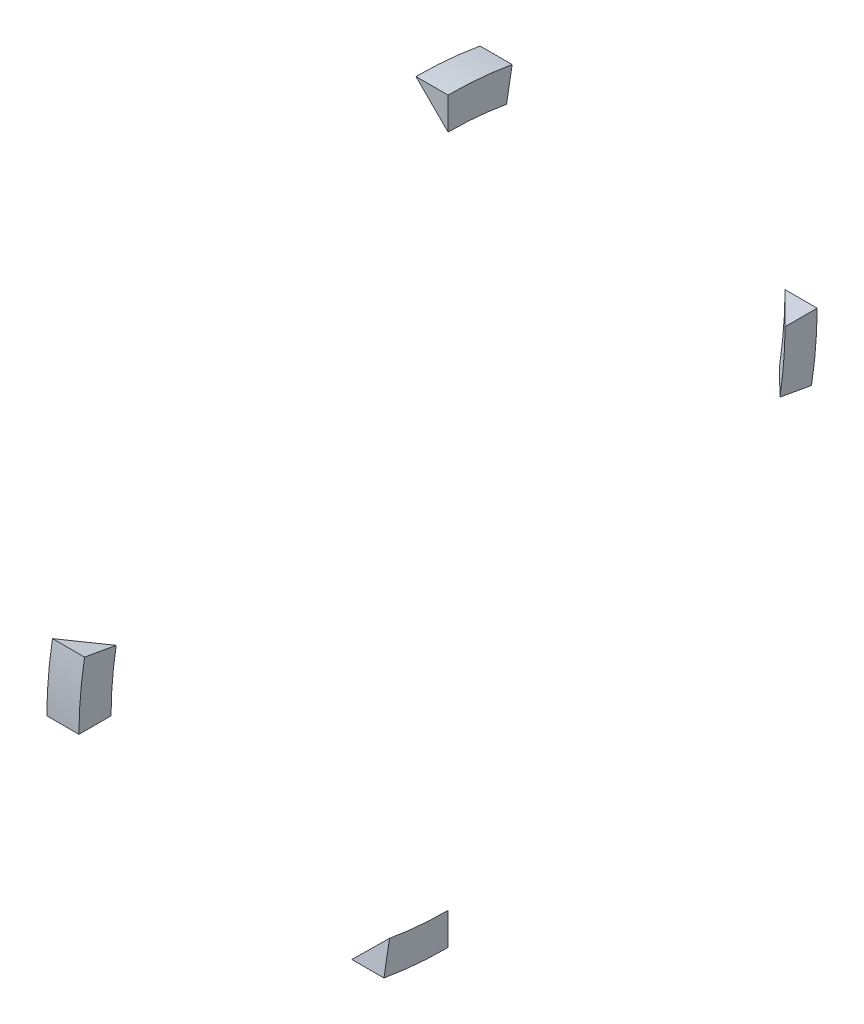
ISO-10303-21;
HEADER;
FILE_DESCRIPTION(('STEP AP214'),'2;1');
FILE_NAME('part.step','',(''),(''),'','','');
FILE_SCHEMA(('AUTOMOTIVE_DESIGN { 1 0 10303 214 1 1 1 1 }'));
ENDSEC;
DATA;
#1=APPLICATION_CONTEXT('core data for automotive mechanical design processes');
#2=APPLICATION_PROTOCOL_DEFINITION('international standard','automotive_design',2000,#1);
#3=PRODUCT_CONTEXT('',#1,'mechanical');
#4=PRODUCT('Part','Part','',(#3));
#5=PRODUCT_RELATED_PRODUCT_CATEGORY('part','',(#4));
#6=PRODUCT_DEFINITION_FORMATION('','',#4);
#7=PRODUCT_DEFINITION_CONTEXT('part definition',#1,'design');
#8=PRODUCT_DEFINITION('design','',#6,#7);
#9=PRODUCT_DEFINITION_SHAPE('','',#8);
#10=(LENGTH_UNIT() NAMED_UNIT(*) SI_UNIT(.MILLI.,.METRE.));
#11=(NAMED_UNIT(*) PLANE_ANGLE_UNIT() SI_UNIT($,.RADIAN.));
#12=(NAMED_UNIT(*) SI_UNIT($,.STERADIAN.) SOLID_ANGLE_UNIT());
#13=UNCERTAINTY_MEASURE_WITH_UNIT(LENGTH_MEASURE(1.E-05),#10,'distance_accuracy_value','');
#14=(GEOMETRIC_REPRESENTATION_CONTEXT(3) GLOBAL_UNCERTAINTY_ASSIGNED_CONTEXT((#13)) GLOBAL_UNIT_ASSIGNED_CONTEXT((#10,
#11,#12)) REPRESENTATION_CONTEXT('',''));
#15=CARTESIAN_POINT('',(0.,0.,0.));
#16=DIRECTION('',(0.,0.,1.));
#17=DIRECTION('',(1.,0.,0.));
#18=AXIS2_PLACEMENT_3D('',#15,#16,#17);
#19=CARTESIAN_POINT('',(0.,-122.894015508113,131.324113864178));
#20=DIRECTION('',(1.,0.,0.));
#21=DIRECTION('',(0.,1.,0.));
#22=AXIS2_PLACEMENT_3D('',#19,#20,#21);
#23=PLANE('',#22);
#24=CARTESIAN_POINT('',(0.,-146.05,0.));
#25=DIRECTION('',(1.,0.,0.));
#26=DIRECTION('',(0.,1.,0.));
#27=AXIS2_PLACEMENT_3D('',#24,#25,#26);
#28=CIRCLE('',#27,146.05);
#29=CARTESIAN_POINT('',(0.,-120.688683651743,143.831172327433));
#30=VERTEX_POINT('',#29);
#31=CARTESIAN_POINT('',(0.,-146.049999999998,146.05));
#32=VERTEX_POINT('',#31);
#33=EDGE_CURVE('E12',#30,#32,#28,.T.);
#34=ORIENTED_EDGE('',*,*,#33,.T.);
#35=DIRECTION('',(0.,0.,1.));
#36=VECTOR('',#35,1.);
#37=CARTESIAN_POINT('',(0.,-146.049999999999,133.35));
#38=LINE('',#37,#36);
#39=CARTESIAN_POINT('',(0.,-146.049999999999,133.35));
#40=VERTEX_POINT('',#39);
#41=EDGE_CURVE('E83',#40,#32,#38,.T.);
#42=ORIENTED_EDGE('',*,*,#41,.F.);
#43=CARTESIAN_POINT('',(0.,-146.05,0.));
#44=DIRECTION('',(1.,0.,0.));
#45=DIRECTION('',(0.,1.,0.));
#46=AXIS2_PLACEMENT_3D('',#43,#44,#45);
#47=CIRCLE('',#46,133.35);
#48=CARTESIAN_POINT('',(0.,-122.894015508113,131.324113864178));
#49=VERTEX_POINT('',#48);
#50=EDGE_CURVE('E65',#49,#40,#47,.T.);
#51=ORIENTED_EDGE('',*,*,#50,.F.);
#52=DIRECTION('',(0.,0.173648177666941,0.984807753012206));
#53=VECTOR('',#52,1.);
#54=CARTESIAN_POINT('',(0.,-122.894015508113,131.324113864178));
#55=LINE('',#54,#53);
#56=EDGE_CURVE('E85',#49,#30,#55,.T.);
#57=ORIENTED_EDGE('',*,*,#56,.T.);
#58=EDGE_LOOP('',(#34,#42,#51,#57));
#59=FACE_BOUND('',#58,.T.);
#60=ADVANCED_FACE('F50',(#59),#23,.T.);
#61=CARTESIAN_POINT('',(0.,-146.05,0.));
#62=DIRECTION('',(1.,0.,0.));
#63=DIRECTION('',(0.,1.,0.));
#64=AXIS2_PLACEMENT_3D('',#61,#62,#63);
#65=CYLINDRICAL_SURFACE('',#64,146.05);
#66=CARTESIAN_POINT('',(-12.7,-146.05,0.));
#67=DIRECTION('',(1.,0.,0.));
#68=DIRECTION('',(0.,1.,0.));
#69=AXIS2_PLACEMENT_3D('',#66,#67,#68);
#70=CIRCLE('',#69,146.05);
#71=CARTESIAN_POINT('',(-12.7,-120.688683651743,143.831172327433));
#72=VERTEX_POINT('',#71);
#73=CARTESIAN_POINT('',(-12.7,-146.049999999998,146.05));
#74=VERTEX_POINT('',#73);
#75=EDGE_CURVE('E58',#72,#74,#70,.T.);
#76=ORIENTED_EDGE('',*,*,#75,.T.);
#77=DIRECTION('',(-1.,0.,0.));
#78=VECTOR('',#77,1.);
#79=CARTESIAN_POINT('',(0.,-146.049999999998,146.05));
#80=LINE('',#79,#78);
#81=EDGE_CURVE('E92',#32,#74,#80,.T.);
#82=ORIENTED_EDGE('',*,*,#81,.F.);
#83=ORIENTED_EDGE('',*,*,#33,.F.);
#84=DIRECTION('',(-1.,0.,0.));
#85=VECTOR('',#84,1.);
#86=CARTESIAN_POINT('',(0.,-120.688683651743,143.831172327433));
#87=LINE('',#86,#85);
#88=EDGE_CURVE('E99',#30,#72,#87,.T.);
#89=ORIENTED_EDGE('',*,*,#88,.T.);
#90=EDGE_LOOP('',(#76,#82,#83,#89));
#91=FACE_BOUND('',#90,.T.);
#92=ADVANCED_FACE('F52',(#91),#65,.T.);
#93=CARTESIAN_POINT('',(-12.7,-146.05,0.));
#94=DIRECTION('',(-1.,0.,0.));
#95=DIRECTION('',(0.,-1.,0.));
#96=AXIS2_PLACEMENT_3D('',#93,#94,#95);
#97=CONICAL_SURFACE('',#96,146.05,0.785398163397449);
#98=DIRECTION('',(0.707106781186548,-0.12278780396898,-0.696364240320018));
#99=VECTOR('',#98,1.);
#100=CARTESIAN_POINT('',(-12.7,-120.688683651743,143.831172327433));
#101=LINE('',#100,#99);
#102=EDGE_CURVE('E101',#72,#49,#101,.T.);
#103=ORIENTED_EDGE('',*,*,#102,.T.);
#104=ORIENTED_EDGE('',*,*,#50,.T.);
#105=DIRECTION('',(0.707106781186548,0.,-0.707106781186547));
#106=VECTOR('',#105,1.);
#107=CARTESIAN_POINT('',(-12.7,-146.049999999998,146.05));
#108=LINE('',#107,#106);
#109=EDGE_CURVE('E93',#74,#40,#108,.T.);
#110=ORIENTED_EDGE('',*,*,#109,.F.);
#111=ORIENTED_EDGE('',*,*,#75,.F.);
#112=EDGE_LOOP('',(#103,#104,#110,#111));
#113=FACE_BOUND('',#112,.T.);
#114=ADVANCED_FACE('F103',(#113),#97,.F.);
#115=CARTESIAN_POINT('',(0.,-120.688683651743,143.831172327433));
#116=DIRECTION('',(0.,-0.984807753012206,0.173648177666941));
#117=DIRECTION('',(1.,0.,0.));
#118=AXIS2_PLACEMENT_3D('',#115,#116,#117);
#119=PLANE('',#118);
#120=ORIENTED_EDGE('',*,*,#56,.F.);
#121=ORIENTED_EDGE('',*,*,#102,.F.);
#122=ORIENTED_EDGE('',*,*,#88,.F.);
#123=EDGE_LOOP('',(#120,#121,#122));
#124=FACE_BOUND('',#123,.T.);
#125=ADVANCED_FACE('F106',(#124),#119,.F.);
#126=CARTESIAN_POINT('',(0.,-146.049999999998,146.05));
#127=DIRECTION('',(0.,-1.,0.));
#128=DIRECTION('',(1.,0.,0.));
#129=AXIS2_PLACEMENT_3D('',#126,#127,#128);
#130=PLANE('',#129);
#131=ORIENTED_EDGE('',*,*,#41,.T.);
#132=ORIENTED_EDGE('',*,*,#81,.T.);
#133=ORIENTED_EDGE('',*,*,#109,.T.);
#134=EDGE_LOOP('',(#131,#132,#133));
#135=FACE_BOUND('',#134,.T.);
#136=ADVANCED_FACE('F91',(#135),#130,.T.);
#137=CLOSED_SHELL('',(#60,#92,#114,#125,#136));
#138=MANIFOLD_SOLID_BREP('B2',#137);
#139=CARTESIAN_POINT('',(0.,-277.374113864178,23.1559844918852));
#140=DIRECTION('',(1.,0.,0.));
#141=DIRECTION('',(0.,0.,1.));
#142=AXIS2_PLACEMENT_3D('',#139,#140,#141);
#143=PLANE('',#142);
#144=CARTESIAN_POINT('',(0.,-146.05,0.));
#145=DIRECTION('',(1.,0.,0.));
#146=DIRECTION('',(0.,0.,1.));
#147=AXIS2_PLACEMENT_3D('',#144,#145,#146);
#148=CIRCLE('',#147,146.05);
#149=CARTESIAN_POINT('',(0.,-289.881172327433,25.3613163482552));
#150=VERTEX_POINT('',#149);
#151=CARTESIAN_POINT('',(0.,-292.1,0.));
#152=VERTEX_POINT('',#151);
#153=EDGE_CURVE('E48',#150,#152,#148,.T.);
#154=ORIENTED_EDGE('',*,*,#153,.T.);
#155=DIRECTION('',(0.,-1.,0.));
#156=VECTOR('',#155,1.);
#157=CARTESIAN_POINT('',(0.,-279.4,0.));
#158=LINE('',#157,#156);
#159=CARTESIAN_POINT('',(0.,-279.4,0.));
#160=VERTEX_POINT('',#159);
#161=EDGE_CURVE('E191',#160,#152,#158,.T.);
#162=ORIENTED_EDGE('',*,*,#161,.F.);
#163=CARTESIAN_POINT('',(0.,-146.05,0.));
#164=DIRECTION('',(1.,0.,0.));
#165=DIRECTION('',(0.,0.,1.));
#166=AXIS2_PLACEMENT_3D('',#163,#164,#165);
#167=CIRCLE('',#166,133.35);
#168=CARTESIAN_POINT('',(0.,-277.374113864178,23.1559844918852));
#169=VERTEX_POINT('',#168);
#170=EDGE_CURVE('E173',#169,#160,#167,.T.);
#171=ORIENTED_EDGE('',*,*,#170,.F.);
#172=DIRECTION('',(0.,-0.984807753012208,0.173648177666931));
#173=VECTOR('',#172,1.);
#174=CARTESIAN_POINT('',(0.,-277.374113864178,23.1559844918852));
#175=LINE('',#174,#173);
#176=EDGE_CURVE('E193',#169,#150,#175,.T.);
#177=ORIENTED_EDGE('',*,*,#176,.T.);
#178=EDGE_LOOP('',(#154,#162,#171,#177));
#179=FACE_BOUND('',#178,.T.);
#180=ADVANCED_FACE('F158',(#179),#143,.T.);
#181=CARTESIAN_POINT('',(0.,-146.05,0.));
#182=DIRECTION('',(1.,0.,0.));
#183=DIRECTION('',(0.,0.,1.));
#184=AXIS2_PLACEMENT_3D('',#181,#182,#183);
#185=CYLINDRICAL_SURFACE('',#184,146.05);
#186=CARTESIAN_POINT('',(-12.7,-146.05,0.));
#187=DIRECTION('',(1.,0.,0.));
#188=DIRECTION('',(0.,0.,1.));
#189=AXIS2_PLACEMENT_3D('',#186,#187,#188);
#190=CIRCLE('',#189,146.05);
#191=CARTESIAN_POINT('',(-12.7,-289.881172327433,25.3613163482552));
#192=VERTEX_POINT('',#191);
#193=CARTESIAN_POINT('',(-12.7,-292.1,0.));
#194=VERTEX_POINT('',#193);
#195=EDGE_CURVE('E166',#192,#194,#190,.T.);
#196=ORIENTED_EDGE('',*,*,#195,.T.);
#197=DIRECTION('',(-1.,0.,0.));
#198=VECTOR('',#197,1.);
#199=CARTESIAN_POINT('',(0.,-292.1,0.));
#200=LINE('',#199,#198);
#201=EDGE_CURVE('E200',#152,#194,#200,.T.);
#202=ORIENTED_EDGE('',*,*,#201,.F.);
#203=ORIENTED_EDGE('',*,*,#153,.F.);
#204=DIRECTION('',(-1.,0.,0.));
#205=VECTOR('',#204,1.);
#206=CARTESIAN_POINT('',(0.,-289.881172327433,25.3613163482552));
#207=LINE('',#206,#205);
#208=EDGE_CURVE('E207',#150,#192,#207,.T.);
#209=ORIENTED_EDGE('',*,*,#208,.T.);
#210=EDGE_LOOP('',(#196,#202,#203,#209));
#211=FACE_BOUND('',#210,.T.);
#212=ADVANCED_FACE('F160',(#211),#185,.T.);
#213=CARTESIAN_POINT('',(-12.7,-146.05,0.));
#214=DIRECTION('',(-1.,0.,0.));
#215=DIRECTION('',(0.,0.,-1.));
#216=AXIS2_PLACEMENT_3D('',#213,#214,#215);
#217=CONICAL_SURFACE('',#216,146.05,0.785398163397449);
#218=DIRECTION('',(0.707106781186548,0.696364240320019,-0.122787803968973));
#219=VECTOR('',#218,1.);
#220=CARTESIAN_POINT('',(-12.7,-289.881172327433,25.3613163482552));
#221=LINE('',#220,#219);
#222=EDGE_CURVE('E209',#192,#169,#221,.T.);
#223=ORIENTED_EDGE('',*,*,#222,.T.);
#224=ORIENTED_EDGE('',*,*,#170,.T.);
#225=DIRECTION('',(0.707106781186548,0.707106781186547,0.));
#226=VECTOR('',#225,1.);
#227=CARTESIAN_POINT('',(-12.7,-292.1,0.));
#228=LINE('',#227,#226);
#229=EDGE_CURVE('E201',#194,#160,#228,.T.);
#230=ORIENTED_EDGE('',*,*,#229,.F.);
#231=ORIENTED_EDGE('',*,*,#195,.F.);
#232=EDGE_LOOP('',(#223,#224,#230,#231));
#233=FACE_BOUND('',#232,.T.);
#234=ADVANCED_FACE('F211',(#233),#217,.F.);
#235=CARTESIAN_POINT('',(0.,-289.881172327433,25.3613163482552));
#236=DIRECTION('',(0.,-0.173648177666931,-0.984807753012208));
#237=DIRECTION('',(1.,0.,0.));
#238=AXIS2_PLACEMENT_3D('',#235,#236,#237);
#239=PLANE('',#238);
#240=ORIENTED_EDGE('',*,*,#176,.F.);
#241=ORIENTED_EDGE('',*,*,#222,.F.);
#242=ORIENTED_EDGE('',*,*,#208,.F.);
#243=EDGE_LOOP('',(#240,#241,#242));
#244=FACE_BOUND('',#243,.T.);
#245=ADVANCED_FACE('F214',(#244),#239,.F.);
#246=CARTESIAN_POINT('',(0.,-292.1,0.));
#247=DIRECTION('',(0.,0.,-1.));
#248=DIRECTION('',(1.,0.,0.));
#249=AXIS2_PLACEMENT_3D('',#246,#247,#248);
#250=PLANE('',#249);
#251=ORIENTED_EDGE('',*,*,#161,.T.);
#252=ORIENTED_EDGE('',*,*,#201,.T.);
#253=ORIENTED_EDGE('',*,*,#229,.T.);
#254=EDGE_LOOP('',(#251,#252,#253));
#255=FACE_BOUND('',#254,.T.);
#256=ADVANCED_FACE('F199',(#255),#250,.T.);
#257=CLOSED_SHELL('',(#180,#212,#234,#245,#256));
#258=MANIFOLD_SOLID_BREP('B6',#257);
#259=CARTESIAN_POINT('',(0.,-169.205984491886,-131.324113864178));
#260=DIRECTION('',(1.,0.,0.));
#261=DIRECTION('',(0.,-1.,0.));
#262=AXIS2_PLACEMENT_3D('',#259,#260,#261);
#263=PLANE('',#262);
#264=CARTESIAN_POINT('',(0.,-146.05,0.));
#265=DIRECTION('',(1.,0.,0.));
#266=DIRECTION('',(0.,-1.,0.));
#267=AXIS2_PLACEMENT_3D('',#264,#265,#266);
#268=CIRCLE('',#267,146.05);
#269=CARTESIAN_POINT('',(0.,-171.411316348256,-143.831172327433));
#270=VERTEX_POINT('',#269);
#271=CARTESIAN_POINT('',(0.,-146.05,-146.05));
#272=VERTEX_POINT('',#271);
#273=EDGE_CURVE('E156',#270,#272,#268,.T.);
#274=ORIENTED_EDGE('',*,*,#273,.T.);
#275=DIRECTION('',(0.,0.,-1.));
#276=VECTOR('',#275,1.);
#277=CARTESIAN_POINT('',(0.,-146.05,-133.35));
#278=LINE('',#277,#276);
#279=CARTESIAN_POINT('',(0.,-146.05,-133.35));
#280=VERTEX_POINT('',#279);
#281=EDGE_CURVE('E299',#280,#272,#278,.T.);
#282=ORIENTED_EDGE('',*,*,#281,.F.);
#283=CARTESIAN_POINT('',(0.,-146.05,0.));
#284=DIRECTION('',(1.,0.,0.));
#285=DIRECTION('',(0.,-1.,0.));
#286=AXIS2_PLACEMENT_3D('',#283,#284,#285);
#287=CIRCLE('',#286,133.35);
#288=CARTESIAN_POINT('',(0.,-169.205984491886,-131.324113864178));
#289=VERTEX_POINT('',#288);
#290=EDGE_CURVE('E281',#289,#280,#287,.T.);
#291=ORIENTED_EDGE('',*,*,#290,.F.);
#292=DIRECTION('',(0.,-0.173648177666934,-0.984807753012207));
#293=VECTOR('',#292,1.);
#294=CARTESIAN_POINT('',(0.,-169.205984491886,-131.324113864178));
#295=LINE('',#294,#293);
#296=EDGE_CURVE('E301',#289,#270,#295,.T.);
#297=ORIENTED_EDGE('',*,*,#296,.T.);
#298=EDGE_LOOP('',(#274,#282,#291,#297));
#299=FACE_BOUND('',#298,.T.);
#300=ADVANCED_FACE('F265',(#299),#263,.T.);
#301=CARTESIAN_POINT('',(0.,-146.05,0.));
#302=DIRECTION('',(1.,0.,0.));
#303=DIRECTION('',(0.,-1.,0.));
#304=AXIS2_PLACEMENT_3D('',#301,#302,#303);
#305=CYLINDRICAL_SURFACE('',#304,146.05);
#306=CARTESIAN_POINT('',(-12.7,-146.05,0.));
#307=DIRECTION('',(1.,0.,0.));
#308=DIRECTION('',(0.,-1.,0.));
#309=AXIS2_PLACEMENT_3D('',#306,#307,#308);
#310=CIRCLE('',#309,146.05);
#311=CARTESIAN_POINT('',(-12.7,-171.411316348256,-143.831172327433));
#312=VERTEX_POINT('',#311);
#313=CARTESIAN_POINT('',(-12.7,-146.05,-146.05));
#314=VERTEX_POINT('',#313);
#315=EDGE_CURVE('E274',#312,#314,#310,.T.);
#316=ORIENTED_EDGE('',*,*,#315,.T.);
#317=DIRECTION('',(-1.,0.,0.));
#318=VECTOR('',#317,1.);
#319=CARTESIAN_POINT('',(0.,-146.05,-146.05));
#320=LINE('',#319,#318);
#321=EDGE_CURVE('E308',#272,#314,#320,.T.);
#322=ORIENTED_EDGE('',*,*,#321,.F.);
#323=ORIENTED_EDGE('',*,*,#273,.F.);
#324=DIRECTION('',(-1.,0.,0.));
#325=VECTOR('',#324,1.);
#326=CARTESIAN_POINT('',(0.,-171.411316348256,-143.831172327433));
#327=LINE('',#326,#325);
#328=EDGE_CURVE('E319',#270,#312,#327,.T.);
#329=ORIENTED_EDGE('',*,*,#328,.T.);
#330=EDGE_LOOP('',(#316,#322,#323,#329));
#331=FACE_BOUND('',#330,.T.);
#332=ADVANCED_FACE('F267',(#331),#305,.T.);
#333=CARTESIAN_POINT('',(-12.7,-146.05,0.));
#334=DIRECTION('',(-1.,0.,0.));
#335=DIRECTION('',(0.,1.,0.));
#336=AXIS2_PLACEMENT_3D('',#333,#334,#335);
#337=CONICAL_SURFACE('',#336,146.05,0.785398163397449);
#338=DIRECTION('',(0.707106781186548,0.122787803968976,0.696364240320018));
#339=VECTOR('',#338,1.);
#340=CARTESIAN_POINT('',(-12.7,-171.411316348256,-143.831172327433));
#341=LINE('',#340,#339);
#342=EDGE_CURVE('E322',#312,#289,#341,.T.);
#343=ORIENTED_EDGE('',*,*,#342,.T.);
#344=ORIENTED_EDGE('',*,*,#290,.T.);
#345=DIRECTION('',(0.707106781186548,0.,0.707106781186547));
#346=VECTOR('',#345,1.);
#347=CARTESIAN_POINT('',(-12.7,-146.05,-146.05));
#348=LINE('',#347,#346);
#349=EDGE_CURVE('E309',#314,#280,#348,.T.);
#350=ORIENTED_EDGE('',*,*,#349,.F.);
#351=ORIENTED_EDGE('',*,*,#315,.F.);
#352=EDGE_LOOP('',(#343,#344,#350,#351));
#353=FACE_BOUND('',#352,.T.);
#354=ADVANCED_FACE('F327',(#353),#337,.F.);
#355=CARTESIAN_POINT('',(0.,-171.411316348256,-143.831172327433));
#356=DIRECTION('',(0.,0.984807753012207,-0.173648177666934));
#357=DIRECTION('',(1.,0.,0.));
#358=AXIS2_PLACEMENT_3D('',#355,#356,#357);
#359=PLANE('',#358);
#360=ORIENTED_EDGE('',*,*,#296,.F.);
#361=ORIENTED_EDGE('',*,*,#342,.F.);
#362=ORIENTED_EDGE('',*,*,#328,.F.);
#363=EDGE_LOOP('',(#360,#361,#362));
#364=FACE_BOUND('',#363,.T.);
#365=ADVANCED_FACE('F330',(#364),#359,.F.);
#366=CARTESIAN_POINT('',(0.,-146.05,-146.05));
#367=DIRECTION('',(0.,1.,0.));
#368=DIRECTION('',(1.,0.,0.));
#369=AXIS2_PLACEMENT_3D('',#366,#367,#368);
#370=PLANE('',#369);
#371=ORIENTED_EDGE('',*,*,#281,.T.);
#372=ORIENTED_EDGE('',*,*,#321,.T.);
#373=ORIENTED_EDGE('',*,*,#349,.T.);
#374=EDGE_LOOP('',(#371,#372,#373));
#375=FACE_BOUND('',#374,.T.);
#376=ADVANCED_FACE('F307',(#375),#370,.T.);
#377=CLOSED_SHELL('',(#300,#332,#354,#365,#376));
#378=MANIFOLD_SOLID_BREP('B42',#377);
#379=CARTESIAN_POINT('',(0.,-14.7258861358221,-23.1559844918852));
#380=DIRECTION('',(1.,0.,0.));
#381=DIRECTION('',(0.,0.,-1.));
#382=AXIS2_PLACEMENT_3D('',#379,#380,#381);
#383=PLANE('',#382);
#384=CARTESIAN_POINT('',(0.,-146.05,0.));
#385=DIRECTION('',(1.,0.,0.));
#386=DIRECTION('',(0.,0.,-1.));
#387=AXIS2_PLACEMENT_3D('',#384,#385,#386);
#388=CIRCLE('',#387,146.05);
#389=CARTESIAN_POINT('',(0.,-2.21882767256702,-25.3613163482552));
#390=VERTEX_POINT('',#389);
#391=CARTESIAN_POINT('',(0.,0.,0.));
#392=VERTEX_POINT('',#391);
#393=EDGE_CURVE('E263',#390,#392,#388,.T.);
#394=ORIENTED_EDGE('',*,*,#393,.T.);
#395=DIRECTION('',(0.,1.,0.));
#396=VECTOR('',#395,1.);
#397=CARTESIAN_POINT('',(0.,-12.7,0.));
#398=LINE('',#397,#396);
#399=CARTESIAN_POINT('',(0.,-12.7,0.));
#400=VERTEX_POINT('',#399);
#401=EDGE_CURVE('E405',#400,#392,#398,.T.);
#402=ORIENTED_EDGE('',*,*,#401,.F.);
#403=CARTESIAN_POINT('',(0.,-146.05,0.));
#404=DIRECTION('',(1.,0.,0.));
#405=DIRECTION('',(0.,0.,-1.));
#406=AXIS2_PLACEMENT_3D('',#403,#404,#405);
#407=CIRCLE('',#406,133.35);
#408=CARTESIAN_POINT('',(0.,-14.7258861358221,-23.1559844918852));
#409=VERTEX_POINT('',#408);
#410=EDGE_CURVE('E387',#409,#400,#407,.T.);
#411=ORIENTED_EDGE('',*,*,#410,.F.);
#412=DIRECTION('',(0.,0.984807753012208,-0.173648177666931));
#413=VECTOR('',#412,1.);
#414=CARTESIAN_POINT('',(0.,-14.7258861358221,-23.1559844918852));
#415=LINE('',#414,#413);
#416=EDGE_CURVE('E407',#409,#390,#415,.T.);
#417=ORIENTED_EDGE('',*,*,#416,.T.);
#418=EDGE_LOOP('',(#394,#402,#411,#417));
#419=FACE_BOUND('',#418,.T.);
#420=ADVANCED_FACE('F372',(#419),#383,.T.);
#421=CARTESIAN_POINT('',(0.,-146.05,0.));
#422=DIRECTION('',(1.,0.,0.));
#423=DIRECTION('',(0.,0.,-1.));
#424=AXIS2_PLACEMENT_3D('',#421,#422,#423);
#425=CYLINDRICAL_SURFACE('',#424,146.05);
#426=CARTESIAN_POINT('',(-12.7,-146.05,0.));
#427=DIRECTION('',(1.,0.,0.));
#428=DIRECTION('',(0.,0.,-1.));
#429=AXIS2_PLACEMENT_3D('',#426,#427,#428);
#430=CIRCLE('',#429,146.05);
#431=CARTESIAN_POINT('',(-12.7,-2.21882767256702,-25.3613163482552));
#432=VERTEX_POINT('',#431);
#433=CARTESIAN_POINT('',(-12.7,0.,0.));
#434=VERTEX_POINT('',#433);
#435=EDGE_CURVE('E380',#432,#434,#430,.T.);
#436=ORIENTED_EDGE('',*,*,#435,.T.);
#437=DIRECTION('',(-1.,0.,0.));
#438=VECTOR('',#437,1.);
#439=CARTESIAN_POINT('',(0.,0.,0.));
#440=LINE('',#439,#438);
#441=EDGE_CURVE('E414',#392,#434,#440,.T.);
#442=ORIENTED_EDGE('',*,*,#441,.F.);
#443=ORIENTED_EDGE('',*,*,#393,.F.);
#444=DIRECTION('',(-1.,0.,0.));
#445=VECTOR('',#444,1.);
#446=CARTESIAN_POINT('',(0.,-2.21882767256702,-25.3613163482552));
#447=LINE('',#446,#445);
#448=EDGE_CURVE('E421',#390,#432,#447,.T.);
#449=ORIENTED_EDGE('',*,*,#448,.T.);
#450=EDGE_LOOP('',(#436,#442,#443,#449));
#451=FACE_BOUND('',#450,.T.);
#452=ADVANCED_FACE('F374',(#451),#425,.T.);
#453=CARTESIAN_POINT('',(-12.7,-146.05,0.));
#454=DIRECTION('',(-1.,0.,0.));
#455=DIRECTION('',(0.,0.,1.));
#456=AXIS2_PLACEMENT_3D('',#453,#454,#455);
#457=CONICAL_SURFACE('',#456,146.05,0.785398163397449);
#458=DIRECTION('',(0.707106781186548,-0.696364240320019,0.122787803968973));
#459=VECTOR('',#458,1.);
#460=CARTESIAN_POINT('',(-12.7,-2.21882767256702,-25.3613163482552));
#461=LINE('',#460,#459);
#462=EDGE_CURVE('E423',#432,#409,#461,.T.);
#463=ORIENTED_EDGE('',*,*,#462,.T.);
#464=ORIENTED_EDGE('',*,*,#410,.T.);
#465=DIRECTION('',(0.707106781186548,-0.707106781186547,0.));
#466=VECTOR('',#465,1.);
#467=CARTESIAN_POINT('',(-12.7,0.,0.));
#468=LINE('',#467,#466);
#469=EDGE_CURVE('E415',#434,#400,#468,.T.);
#470=ORIENTED_EDGE('',*,*,#469,.F.);
#471=ORIENTED_EDGE('',*,*,#435,.F.);
#472=EDGE_LOOP('',(#463,#464,#470,#471));
#473=FACE_BOUND('',#472,.T.);
#474=ADVANCED_FACE('F425',(#473),#457,.F.);
#475=CARTESIAN_POINT('',(0.,-2.21882767256702,-25.3613163482552));
#476=DIRECTION('',(0.,0.173648177666931,0.984807753012208));
#477=DIRECTION('',(1.,0.,0.));
#478=AXIS2_PLACEMENT_3D('',#475,#476,#477);
#479=PLANE('',#478);
#480=ORIENTED_EDGE('',*,*,#416,.F.);
#481=ORIENTED_EDGE('',*,*,#462,.F.);
#482=ORIENTED_EDGE('',*,*,#448,.F.);
#483=EDGE_LOOP('',(#480,#481,#482));
#484=FACE_BOUND('',#483,.T.);
#485=ADVANCED_FACE('F428',(#484),#479,.F.);
#486=CARTESIAN_POINT('',(0.,0.,0.));
#487=DIRECTION('',(0.,0.,1.));
#488=DIRECTION('',(1.,0.,0.));
#489=AXIS2_PLACEMENT_3D('',#486,#487,#488);
#490=PLANE('',#489);
#491=ORIENTED_EDGE('',*,*,#401,.T.);
#492=ORIENTED_EDGE('',*,*,#441,.T.);
#493=ORIENTED_EDGE('',*,*,#469,.T.);
#494=EDGE_LOOP('',(#491,#492,#493));
#495=FACE_BOUND('',#494,.T.);
#496=ADVANCED_FACE('F413',(#495),#490,.T.);
#497=CLOSED_SHELL('',(#420,#452,#474,#485,#496));
#498=MANIFOLD_SOLID_BREP('B150',#497);
#499=ADVANCED_BREP_SHAPE_REPRESENTATION('',(#18,#138,#258,#378,#498),#14);
#500=SHAPE_DEFINITION_REPRESENTATION(#9,#499);
ENDSEC;
END-ISO-10303-21;
